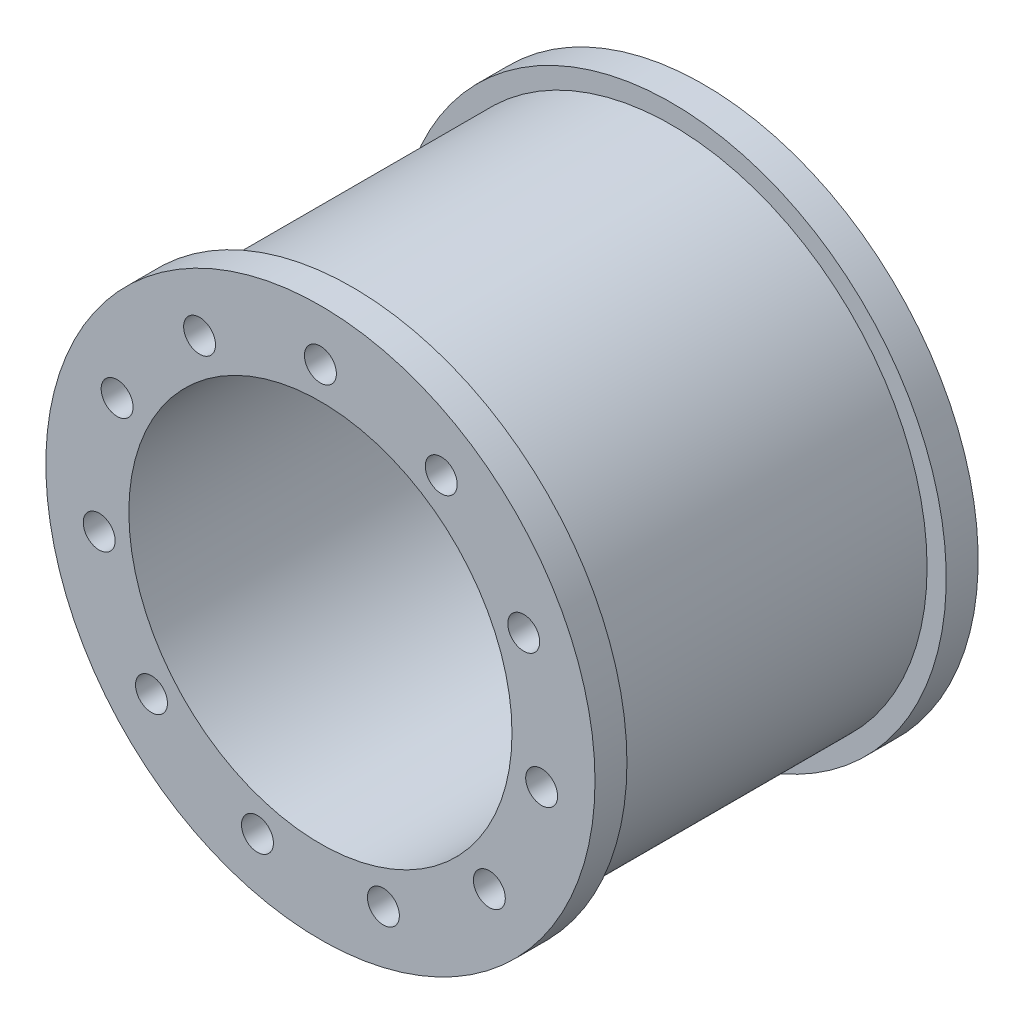
ISO-10303-21;
HEADER;
FILE_DESCRIPTION(('STEP AP214'),'2;1');
FILE_NAME('part.step','',(''),(''),'','','');
FILE_SCHEMA(('AUTOMOTIVE_DESIGN { 1 0 10303 214 1 1 1 1 }'));
ENDSEC;
DATA;
#1=APPLICATION_CONTEXT('core data for automotive mechanical design processes');
#2=APPLICATION_PROTOCOL_DEFINITION('international standard','automotive_design',2000,#1);
#3=PRODUCT_CONTEXT('',#1,'mechanical');
#4=PRODUCT('Part','Part','',(#3));
#5=PRODUCT_RELATED_PRODUCT_CATEGORY('part','',(#4));
#6=PRODUCT_DEFINITION_FORMATION('','',#4);
#7=PRODUCT_DEFINITION_CONTEXT('part definition',#1,'design');
#8=PRODUCT_DEFINITION('design','',#6,#7);
#9=PRODUCT_DEFINITION_SHAPE('','',#8);
#10=(LENGTH_UNIT() NAMED_UNIT(*) SI_UNIT(.MILLI.,.METRE.));
#11=(NAMED_UNIT(*) PLANE_ANGLE_UNIT() SI_UNIT($,.RADIAN.));
#12=(NAMED_UNIT(*) SI_UNIT($,.STERADIAN.) SOLID_ANGLE_UNIT());
#13=UNCERTAINTY_MEASURE_WITH_UNIT(LENGTH_MEASURE(1.E-05),#10,'distance_accuracy_value','');
#14=(GEOMETRIC_REPRESENTATION_CONTEXT(3) GLOBAL_UNCERTAINTY_ASSIGNED_CONTEXT((#13)) GLOBAL_UNIT_ASSIGNED_CONTEXT((#10,
#11,#12)) REPRESENTATION_CONTEXT('',''));
#15=CARTESIAN_POINT('',(0.,0.,0.));
#16=DIRECTION('',(0.,0.,1.));
#17=DIRECTION('',(1.,0.,0.));
#18=AXIS2_PLACEMENT_3D('',#15,#16,#17);
#19=CARTESIAN_POINT('',(0.,0.,50.));
#20=DIRECTION('',(0.,0.,-1.));
#21=DIRECTION('',(-1.,0.,0.));
#22=AXIS2_PLACEMENT_3D('',#19,#20,#21);
#23=CYLINDRICAL_SURFACE('',#22,40.);
#24=CARTESIAN_POINT('',(0.,0.,50.));
#25=DIRECTION('',(0.,0.,1.));
#26=DIRECTION('',(1.,0.,0.));
#27=AXIS2_PLACEMENT_3D('',#24,#25,#26);
#28=CIRCLE('',#27,40.);
#29=CARTESIAN_POINT('',(40.,0.,50.));
#30=VERTEX_POINT('',#29);
#31=EDGE_CURVE('E10',#30,#30,#28,.T.);
#32=ORIENTED_EDGE('',*,*,#31,.F.);
#33=EDGE_LOOP('',(#32));
#34=FACE_BOUND('',#33,.T.);
#35=CARTESIAN_POINT('',(0.,0.,0.));
#36=DIRECTION('',(0.,0.,1.));
#37=DIRECTION('',(1.,0.,0.));
#38=AXIS2_PLACEMENT_3D('',#35,#36,#37);
#39=CIRCLE('',#38,40.);
#40=CARTESIAN_POINT('',(40.,0.,0.));
#41=VERTEX_POINT('',#40);
#42=EDGE_CURVE('E43',#41,#41,#39,.T.);
#43=ORIENTED_EDGE('',*,*,#42,.T.);
#44=EDGE_LOOP('',(#43));
#45=FACE_BOUND('',#44,.T.);
#46=ADVANCED_FACE('F40',(#34,#45),#23,.T.);
#47=CARTESIAN_POINT('',(0.,0.,50.));
#48=DIRECTION('',(0.,0.,-1.));
#49=DIRECTION('',(-1.,0.,0.));
#50=AXIS2_PLACEMENT_3D('',#47,#48,#49);
#51=CYLINDRICAL_SURFACE('',#50,30.);
#52=CARTESIAN_POINT('',(0.,0.,-5.));
#53=DIRECTION('',(0.,0.,-1.));
#54=DIRECTION('',(-1.,0.,0.));
#55=AXIS2_PLACEMENT_3D('',#52,#53,#54);
#56=CIRCLE('',#55,30.);
#57=CARTESIAN_POINT('',(-30.,0.,-5.));
#58=VERTEX_POINT('',#57);
#59=EDGE_CURVE('E100',#58,#58,#56,.T.);
#60=ORIENTED_EDGE('',*,*,#59,.T.);
#61=EDGE_LOOP('',(#60));
#62=FACE_BOUND('',#61,.T.);
#63=CARTESIAN_POINT('',(0.,0.,55.));
#64=DIRECTION('',(0.,0.,1.));
#65=DIRECTION('',(1.,0.,0.));
#66=AXIS2_PLACEMENT_3D('',#63,#64,#65);
#67=CIRCLE('',#66,30.);
#68=CARTESIAN_POINT('',(30.,0.,55.));
#69=VERTEX_POINT('',#68);
#70=EDGE_CURVE('E112',#69,#69,#67,.T.);
#71=ORIENTED_EDGE('',*,*,#70,.T.);
#72=EDGE_LOOP('',(#71));
#73=FACE_BOUND('',#72,.T.);
#74=ADVANCED_FACE('F184',(#62,#73),#51,.F.);
#75=CARTESIAN_POINT('',(0.,0.,-5.));
#76=DIRECTION('',(0.,0.,-1.));
#77=DIRECTION('',(-1.,0.,0.));
#78=AXIS2_PLACEMENT_3D('',#75,#76,#77);
#79=PLANE('',#78);
#80=CARTESIAN_POINT('',(0.,0.,-5.));
#81=DIRECTION('',(0.,0.,-1.));
#82=DIRECTION('',(-1.,0.,0.));
#83=AXIS2_PLACEMENT_3D('',#80,#81,#82);
#84=CIRCLE('',#83,43.);
#85=CARTESIAN_POINT('',(-43.,0.,-5.));
#86=VERTEX_POINT('',#85);
#87=EDGE_CURVE('E99',#86,#86,#84,.T.);
#88=ORIENTED_EDGE('',*,*,#87,.T.);
#89=EDGE_LOOP('',(#88));
#90=FACE_BOUND('',#89,.T.);
#91=ORIENTED_EDGE('',*,*,#59,.F.);
#92=EDGE_LOOP('',(#91));
#93=FACE_BOUND('',#92,.T.);
#94=ADVANCED_FACE('F189',(#90,#93),#79,.T.);
#95=CARTESIAN_POINT('',(0.,0.,0.));
#96=DIRECTION('',(0.,0.,-1.));
#97=DIRECTION('',(-1.,0.,0.));
#98=AXIS2_PLACEMENT_3D('',#95,#96,#97);
#99=PLANE('',#98);
#100=ORIENTED_EDGE('',*,*,#42,.F.);
#101=EDGE_LOOP('',(#100));
#102=FACE_BOUND('',#101,.T.);
#103=CARTESIAN_POINT('',(0.,0.,0.));
#104=DIRECTION('',(0.,0.,-1.));
#105=DIRECTION('',(-1.,0.,0.));
#106=AXIS2_PLACEMENT_3D('',#103,#104,#105);
#107=CIRCLE('',#106,43.);
#108=CARTESIAN_POINT('',(-43.,0.,0.));
#109=VERTEX_POINT('',#108);
#110=EDGE_CURVE('E95',#109,#109,#107,.T.);
#111=ORIENTED_EDGE('',*,*,#110,.F.);
#112=EDGE_LOOP('',(#111));
#113=FACE_BOUND('',#112,.T.);
#114=ADVANCED_FACE('F178',(#102,#113),#99,.F.);
#115=CARTESIAN_POINT('',(0.,0.,-5.));
#116=DIRECTION('',(0.,0.,1.));
#117=DIRECTION('',(1.,0.,0.));
#118=AXIS2_PLACEMENT_3D('',#115,#116,#117);
#119=CYLINDRICAL_SURFACE('',#118,43.);
#120=ORIENTED_EDGE('',*,*,#87,.F.);
#121=EDGE_LOOP('',(#120));
#122=FACE_BOUND('',#121,.T.);
#123=ORIENTED_EDGE('',*,*,#110,.T.);
#124=EDGE_LOOP('',(#123));
#125=FACE_BOUND('',#124,.T.);
#126=ADVANCED_FACE('F169',(#122,#125),#119,.T.);
#127=CARTESIAN_POINT('',(0.,0.,55.));
#128=DIRECTION('',(0.,0.,1.));
#129=DIRECTION('',(1.,0.,0.));
#130=AXIS2_PLACEMENT_3D('',#127,#128,#129);
#131=PLANE('',#130);
#132=CARTESIAN_POINT('',(0.,35.,55.));
#133=DIRECTION('',(0.,0.,1.));
#134=DIRECTION('',(1.,0.,0.));
#135=AXIS2_PLACEMENT_3D('',#132,#133,#134);
#136=CIRCLE('',#135,2.5);
#137=CARTESIAN_POINT('',(2.5,35.,55.));
#138=VERTEX_POINT('',#137);
#139=EDGE_CURVE('E155',#138,#138,#136,.T.);
#140=ORIENTED_EDGE('',*,*,#139,.F.);
#141=EDGE_LOOP('',(#140));
#142=FACE_BOUND('',#141,.T.);
#143=CARTESIAN_POINT('',(-31.8371198374073,14.5395254550647,55.));
#144=DIRECTION('',(0.,0.,1.));
#145=DIRECTION('',(1.,0.,0.));
#146=AXIS2_PLACEMENT_3D('',#143,#144,#145);
#147=CIRCLE('',#146,2.50000000000164);
#148=CARTESIAN_POINT('',(-29.3371198374056,14.5395254550647,55.));
#149=VERTEX_POINT('',#148);
#150=EDGE_CURVE('E147',#149,#149,#147,.T.);
#151=ORIENTED_EDGE('',*,*,#150,.F.);
#152=EDGE_LOOP('',(#151));
#153=FACE_BOUND('',#152,.T.);
#154=CARTESIAN_POINT('',(-26.4512351023966,-22.9201256880861,55.));
#155=DIRECTION('',(0.,0.,1.));
#156=DIRECTION('',(1.,0.,0.));
#157=AXIS2_PLACEMENT_3D('',#154,#155,#156);
#158=CIRCLE('',#157,2.50000000000299);
#159=CARTESIAN_POINT('',(-23.9512351023936,-22.9201256880861,55.));
#160=VERTEX_POINT('',#159);
#161=EDGE_CURVE('E139',#160,#160,#158,.T.);
#162=ORIENTED_EDGE('',*,*,#161,.F.);
#163=EDGE_LOOP('',(#162));
#164=FACE_BOUND('',#163,.T.);
#165=CARTESIAN_POINT('',(9.86063948945295,-33.582254076507,55.));
#166=DIRECTION('',(0.,0.,1.));
#167=DIRECTION('',(1.,0.,0.));
#168=AXIS2_PLACEMENT_3D('',#165,#166,#167);
#169=CIRCLE('',#168,2.50000000000289);
#170=CARTESIAN_POINT('',(12.3606394894558,-33.582254076507,55.));
#171=VERTEX_POINT('',#170);
#172=EDGE_CURVE('E131',#171,#171,#169,.T.);
#173=ORIENTED_EDGE('',*,*,#172,.F.);
#174=EDGE_LOOP('',(#173));
#175=FACE_BOUND('',#174,.T.);
#176=CARTESIAN_POINT('',(34.6437504658343,-4.98101933956351,55.));
#177=DIRECTION('',(0.,0.,1.));
#178=DIRECTION('',(1.,0.,0.));
#179=AXIS2_PLACEMENT_3D('',#176,#177,#178);
#180=CIRCLE('',#179,2.50000000000133);
#181=CARTESIAN_POINT('',(37.1437504658357,-4.98101933956351,55.));
#182=VERTEX_POINT('',#181);
#183=EDGE_CURVE('E123',#182,#182,#180,.T.);
#184=ORIENTED_EDGE('',*,*,#183,.F.);
#185=EDGE_LOOP('',(#184));
#186=FACE_BOUND('',#185,.T.);
#187=ORIENTED_EDGE('',*,*,#70,.F.);
#188=EDGE_LOOP('',(#187));
#189=FACE_BOUND('',#188,.T.);
#190=CARTESIAN_POINT('',(0.,0.,55.));
#191=DIRECTION('',(0.,0.,1.));
#192=DIRECTION('',(1.,0.,0.));
#193=AXIS2_PLACEMENT_3D('',#190,#191,#192);
#194=CIRCLE('',#193,43.);
#195=CARTESIAN_POINT('',(43.,0.,55.));
#196=VERTEX_POINT('',#195);
#197=EDGE_CURVE('E107',#196,#196,#194,.T.);
#198=ORIENTED_EDGE('',*,*,#197,.T.);
#199=EDGE_LOOP('',(#198));
#200=FACE_BOUND('',#199,.T.);
#201=CARTESIAN_POINT('',(31.837119837409,14.5395254550674,55.));
#202=DIRECTION('',(0.,0.,1.));
#203=DIRECTION('',(1.,0.,0.));
#204=AXIS2_PLACEMENT_3D('',#201,#202,#203);
#205=CIRCLE('',#204,2.50000000000053);
#206=CARTESIAN_POINT('',(34.3371198374095,14.5395254550674,55.));
#207=VERTEX_POINT('',#206);
#208=EDGE_CURVE('E119',#207,#207,#205,.T.);
#209=ORIENTED_EDGE('',*,*,#208,.F.);
#210=EDGE_LOOP('',(#209));
#211=FACE_BOUND('',#210,.T.);
#212=CARTESIAN_POINT('',(26.4512351024015,-22.9201256880839,55.));
#213=DIRECTION('',(0.,0.,1.));
#214=DIRECTION('',(1.,0.,0.));
#215=AXIS2_PLACEMENT_3D('',#212,#213,#214);
#216=CIRCLE('',#215,2.5000000000022);
#217=CARTESIAN_POINT('',(28.9512351024037,-22.9201256880839,55.));
#218=VERTEX_POINT('',#217);
#219=EDGE_CURVE('E127',#218,#218,#216,.T.);
#220=ORIENTED_EDGE('',*,*,#219,.F.);
#221=EDGE_LOOP('',(#220));
#222=FACE_BOUND('',#221,.T.);
#223=CARTESIAN_POINT('',(-9.86063948944712,-33.5822540765078,55.));
#224=DIRECTION('',(0.,0.,1.));
#225=DIRECTION('',(1.,0.,0.));
#226=AXIS2_PLACEMENT_3D('',#223,#224,#225);
#227=CIRCLE('',#226,2.50000000000318);
#228=CARTESIAN_POINT('',(-7.36063948944395,-33.5822540765078,55.));
#229=VERTEX_POINT('',#228);
#230=EDGE_CURVE('E135',#229,#229,#227,.T.);
#231=ORIENTED_EDGE('',*,*,#230,.F.);
#232=EDGE_LOOP('',(#231));
#233=FACE_BOUND('',#232,.T.);
#234=CARTESIAN_POINT('',(-34.6437504658309,-4.98101933956645,55.));
#235=DIRECTION('',(0.,0.,1.));
#236=DIRECTION('',(1.,0.,0.));
#237=AXIS2_PLACEMENT_3D('',#234,#235,#236);
#238=CIRCLE('',#237,2.50000000000241);
#239=CARTESIAN_POINT('',(-32.1437504658285,-4.98101933956645,55.));
#240=VERTEX_POINT('',#239);
#241=EDGE_CURVE('E143',#240,#240,#238,.T.);
#242=ORIENTED_EDGE('',*,*,#241,.F.);
#243=EDGE_LOOP('',(#242));
#244=FACE_BOUND('',#243,.T.);
#245=CARTESIAN_POINT('',(-18.9224286109457,29.4438736490905,55.));
#246=DIRECTION('',(0.,0.,1.));
#247=DIRECTION('',(1.,0.,0.));
#248=AXIS2_PLACEMENT_3D('',#245,#246,#247);
#249=CIRCLE('',#248,2.50000000000091);
#250=CARTESIAN_POINT('',(-16.4224286109448,29.4438736490905,55.));
#251=VERTEX_POINT('',#250);
#252=EDGE_CURVE('E151',#251,#251,#249,.T.);
#253=ORIENTED_EDGE('',*,*,#252,.F.);
#254=EDGE_LOOP('',(#253));
#255=FACE_BOUND('',#254,.T.);
#256=CARTESIAN_POINT('',(18.922428610946,29.4438736490913,55.));
#257=DIRECTION('',(0.,0.,1.));
#258=DIRECTION('',(1.,0.,0.));
#259=AXIS2_PLACEMENT_3D('',#256,#257,#258);
#260=CIRCLE('',#259,2.5);
#261=CARTESIAN_POINT('',(21.422428610946,29.4438736490913,55.));
#262=VERTEX_POINT('',#261);
#263=EDGE_CURVE('E159',#262,#262,#260,.T.);
#264=ORIENTED_EDGE('',*,*,#263,.F.);
#265=EDGE_LOOP('',(#264));
#266=FACE_BOUND('',#265,.T.);
#267=ADVANCED_FACE('F166',(#142,#153,#164,#175,#186,#189,#200,#211,#222,#233,#244,#255,#266),
#131,.T.);
#268=CARTESIAN_POINT('',(0.,0.,50.));
#269=DIRECTION('',(0.,0.,1.));
#270=DIRECTION('',(1.,0.,0.));
#271=AXIS2_PLACEMENT_3D('',#268,#269,#270);
#272=PLANE('',#271);
#273=ORIENTED_EDGE('',*,*,#31,.T.);
#274=EDGE_LOOP('',(#273));
#275=FACE_BOUND('',#274,.T.);
#276=CARTESIAN_POINT('',(0.,0.,50.));
#277=DIRECTION('',(0.,0.,1.));
#278=DIRECTION('',(1.,0.,0.));
#279=AXIS2_PLACEMENT_3D('',#276,#277,#278);
#280=CIRCLE('',#279,43.);
#281=CARTESIAN_POINT('',(43.,0.,50.));
#282=VERTEX_POINT('',#281);
#283=EDGE_CURVE('E108',#282,#282,#280,.T.);
#284=ORIENTED_EDGE('',*,*,#283,.F.);
#285=EDGE_LOOP('',(#284));
#286=FACE_BOUND('',#285,.T.);
#287=ADVANCED_FACE('F168',(#275,#286),#272,.F.);
#288=CARTESIAN_POINT('',(0.,0.,55.));
#289=DIRECTION('',(0.,0.,-1.));
#290=DIRECTION('',(-1.,0.,0.));
#291=AXIS2_PLACEMENT_3D('',#288,#289,#290);
#292=CYLINDRICAL_SURFACE('',#291,43.);
#293=ORIENTED_EDGE('',*,*,#197,.F.);
#294=EDGE_LOOP('',(#293));
#295=FACE_BOUND('',#294,.T.);
#296=ORIENTED_EDGE('',*,*,#283,.T.);
#297=EDGE_LOOP('',(#296));
#298=FACE_BOUND('',#297,.T.);
#299=ADVANCED_FACE('F176',(#295,#298),#292,.T.);
#300=CARTESIAN_POINT('',(-18.9224286109457,29.4438736490905,0.));
#301=DIRECTION('',(0.,0.,1.));
#302=DIRECTION('',(1.,0.,0.));
#303=AXIS2_PLACEMENT_3D('',#300,#301,#302);
#304=CIRCLE('',#303,2.50000000000091);
#305=CARTESIAN_POINT('',(-16.4224286109448,29.4438736490905,0.));
#306=VERTEX_POINT('',#305);
#307=EDGE_CURVE('E91',#306,#306,#304,.T.);
#308=ORIENTED_EDGE('',*,*,#307,.T.);
#309=EDGE_LOOP('',(#308));
#310=FACE_BOUND('',#309,.T.);
#311=ADVANCED_FACE('F200',(#310),#99,.F.);
#312=CARTESIAN_POINT('',(-18.9224286109457,29.4438736490905,50.));
#313=DIRECTION('',(0.,0.,-1.));
#314=DIRECTION('',(-1.,0.,0.));
#315=AXIS2_PLACEMENT_3D('',#312,#313,#314);
#316=CYLINDRICAL_SURFACE('',#315,2.50000000000091);
#317=ORIENTED_EDGE('',*,*,#307,.F.);
#318=EDGE_LOOP('',(#317));
#319=FACE_BOUND('',#318,.T.);
#320=ORIENTED_EDGE('',*,*,#252,.T.);
#321=EDGE_LOOP('',(#320));
#322=FACE_BOUND('',#321,.T.);
#323=ADVANCED_FACE('F214',(#319,#322),#316,.F.);
#324=CARTESIAN_POINT('',(-34.6437504658309,-4.98101933956645,0.));
#325=DIRECTION('',(0.,0.,1.));
#326=DIRECTION('',(1.,0.,0.));
#327=AXIS2_PLACEMENT_3D('',#324,#325,#326);
#328=CIRCLE('',#327,2.50000000000241);
#329=CARTESIAN_POINT('',(-32.1437504658285,-4.98101933956645,0.));
#330=VERTEX_POINT('',#329);
#331=EDGE_CURVE('E83',#330,#330,#328,.T.);
#332=ORIENTED_EDGE('',*,*,#331,.T.);
#333=EDGE_LOOP('',(#332));
#334=FACE_BOUND('',#333,.T.);
#335=ADVANCED_FACE('F221',(#334),#99,.F.);
#336=CARTESIAN_POINT('',(-34.6437504658309,-4.98101933956645,50.));
#337=DIRECTION('',(0.,0.,-1.));
#338=DIRECTION('',(-1.,0.,0.));
#339=AXIS2_PLACEMENT_3D('',#336,#337,#338);
#340=CYLINDRICAL_SURFACE('',#339,2.50000000000241);
#341=ORIENTED_EDGE('',*,*,#331,.F.);
#342=EDGE_LOOP('',(#341));
#343=FACE_BOUND('',#342,.T.);
#344=ORIENTED_EDGE('',*,*,#241,.T.);
#345=EDGE_LOOP('',(#344));
#346=FACE_BOUND('',#345,.T.);
#347=ADVANCED_FACE('F240',(#343,#346),#340,.F.);
#348=CARTESIAN_POINT('',(-9.86063948944712,-33.5822540765078,0.));
#349=DIRECTION('',(0.,0.,1.));
#350=DIRECTION('',(1.,0.,0.));
#351=AXIS2_PLACEMENT_3D('',#348,#349,#350);
#352=CIRCLE('',#351,2.50000000000318);
#353=CARTESIAN_POINT('',(-7.36063948944395,-33.5822540765078,0.));
#354=VERTEX_POINT('',#353);
#355=EDGE_CURVE('E75',#354,#354,#352,.T.);
#356=ORIENTED_EDGE('',*,*,#355,.T.);
#357=EDGE_LOOP('',(#356));
#358=FACE_BOUND('',#357,.T.);
#359=ADVANCED_FACE('F245',(#358),#99,.F.);
#360=CARTESIAN_POINT('',(-9.86063948944712,-33.5822540765078,50.));
#361=DIRECTION('',(0.,0.,-1.));
#362=DIRECTION('',(-1.,0.,0.));
#363=AXIS2_PLACEMENT_3D('',#360,#361,#362);
#364=CYLINDRICAL_SURFACE('',#363,2.50000000000318);
#365=ORIENTED_EDGE('',*,*,#355,.F.);
#366=EDGE_LOOP('',(#365));
#367=FACE_BOUND('',#366,.T.);
#368=ORIENTED_EDGE('',*,*,#230,.T.);
#369=EDGE_LOOP('',(#368));
#370=FACE_BOUND('',#369,.T.);
#371=ADVANCED_FACE('F258',(#367,#370),#364,.F.);
#372=CARTESIAN_POINT('',(26.4512351024015,-22.9201256880839,0.));
#373=DIRECTION('',(0.,0.,1.));
#374=DIRECTION('',(1.,0.,0.));
#375=AXIS2_PLACEMENT_3D('',#372,#373,#374);
#376=CIRCLE('',#375,2.5000000000022);
#377=CARTESIAN_POINT('',(28.9512351024037,-22.9201256880839,0.));
#378=VERTEX_POINT('',#377);
#379=EDGE_CURVE('E67',#378,#378,#376,.T.);
#380=ORIENTED_EDGE('',*,*,#379,.T.);
#381=EDGE_LOOP('',(#380));
#382=FACE_BOUND('',#381,.T.);
#383=ADVANCED_FACE('F263',(#382),#99,.F.);
#384=CARTESIAN_POINT('',(26.4512351024015,-22.9201256880839,50.));
#385=DIRECTION('',(0.,0.,-1.));
#386=DIRECTION('',(-1.,0.,0.));
#387=AXIS2_PLACEMENT_3D('',#384,#385,#386);
#388=CYLINDRICAL_SURFACE('',#387,2.5000000000022);
#389=ORIENTED_EDGE('',*,*,#379,.F.);
#390=EDGE_LOOP('',(#389));
#391=FACE_BOUND('',#390,.T.);
#392=ORIENTED_EDGE('',*,*,#219,.T.);
#393=EDGE_LOOP('',(#392));
#394=FACE_BOUND('',#393,.T.);
#395=ADVANCED_FACE('F276',(#391,#394),#388,.F.);
#396=CARTESIAN_POINT('',(31.837119837409,14.5395254550674,0.));
#397=DIRECTION('',(0.,0.,1.));
#398=DIRECTION('',(1.,0.,0.));
#399=AXIS2_PLACEMENT_3D('',#396,#397,#398);
#400=CIRCLE('',#399,2.50000000000053);
#401=CARTESIAN_POINT('',(34.3371198374095,14.5395254550674,0.));
#402=VERTEX_POINT('',#401);
#403=EDGE_CURVE('E59',#402,#402,#400,.T.);
#404=ORIENTED_EDGE('',*,*,#403,.T.);
#405=EDGE_LOOP('',(#404));
#406=FACE_BOUND('',#405,.T.);
#407=ADVANCED_FACE('F281',(#406),#99,.F.);
#408=CARTESIAN_POINT('',(31.837119837409,14.5395254550674,50.));
#409=DIRECTION('',(0.,0.,-1.));
#410=DIRECTION('',(-1.,0.,0.));
#411=AXIS2_PLACEMENT_3D('',#408,#409,#410);
#412=CYLINDRICAL_SURFACE('',#411,2.50000000000053);
#413=ORIENTED_EDGE('',*,*,#403,.F.);
#414=EDGE_LOOP('',(#413));
#415=FACE_BOUND('',#414,.T.);
#416=ORIENTED_EDGE('',*,*,#208,.T.);
#417=EDGE_LOOP('',(#416));
#418=FACE_BOUND('',#417,.T.);
#419=ADVANCED_FACE('F210',(#415,#418),#412,.F.);
#420=CARTESIAN_POINT('',(0.,35.,0.));
#421=DIRECTION('',(0.,0.,1.));
#422=DIRECTION('',(1.,0.,0.));
#423=AXIS2_PLACEMENT_3D('',#420,#421,#422);
#424=CIRCLE('',#423,2.5);
#425=CARTESIAN_POINT('',(2.5,35.,0.));
#426=VERTEX_POINT('',#425);
#427=EDGE_CURVE('E48',#426,#426,#424,.T.);
#428=ORIENTED_EDGE('',*,*,#427,.T.);
#429=EDGE_LOOP('',(#428));
#430=FACE_BOUND('',#429,.T.);
#431=ADVANCED_FACE('F199',(#430),#99,.F.);
#432=CARTESIAN_POINT('',(0.,35.,50.));
#433=DIRECTION('',(0.,0.,-1.));
#434=DIRECTION('',(-1.,0.,0.));
#435=AXIS2_PLACEMENT_3D('',#432,#433,#434);
#436=CYLINDRICAL_SURFACE('',#435,2.5);
#437=ORIENTED_EDGE('',*,*,#427,.F.);
#438=EDGE_LOOP('',(#437));
#439=FACE_BOUND('',#438,.T.);
#440=ORIENTED_EDGE('',*,*,#139,.T.);
#441=EDGE_LOOP('',(#440));
#442=FACE_BOUND('',#441,.T.);
#443=ADVANCED_FACE('F209',(#439,#442),#436,.F.);
#444=CARTESIAN_POINT('',(18.922428610946,29.4438736490913,0.));
#445=DIRECTION('',(0.,0.,1.));
#446=DIRECTION('',(1.,0.,0.));
#447=AXIS2_PLACEMENT_3D('',#444,#445,#446);
#448=CIRCLE('',#447,2.5);
#449=CARTESIAN_POINT('',(21.422428610946,29.4438736490913,0.));
#450=VERTEX_POINT('',#449);
#451=EDGE_CURVE('E53',#450,#450,#448,.T.);
#452=ORIENTED_EDGE('',*,*,#451,.T.);
#453=EDGE_LOOP('',(#452));
#454=FACE_BOUND('',#453,.T.);
#455=ADVANCED_FACE('F212',(#454),#99,.F.);
#456=CARTESIAN_POINT('',(18.922428610946,29.4438736490913,50.));
#457=DIRECTION('',(0.,0.,-1.));
#458=DIRECTION('',(-1.,0.,0.));
#459=AXIS2_PLACEMENT_3D('',#456,#457,#458);
#460=CYLINDRICAL_SURFACE('',#459,2.5);
#461=ORIENTED_EDGE('',*,*,#451,.F.);
#462=EDGE_LOOP('',(#461));
#463=FACE_BOUND('',#462,.T.);
#464=ORIENTED_EDGE('',*,*,#263,.T.);
#465=EDGE_LOOP('',(#464));
#466=FACE_BOUND('',#465,.T.);
#467=ADVANCED_FACE('F164',(#463,#466),#460,.F.);
#468=CARTESIAN_POINT('',(34.6437504658343,-4.98101933956351,0.));
#469=DIRECTION('',(0.,0.,1.));
#470=DIRECTION('',(1.,0.,0.));
#471=AXIS2_PLACEMENT_3D('',#468,#469,#470);
#472=CIRCLE('',#471,2.50000000000133);
#473=CARTESIAN_POINT('',(37.1437504658357,-4.98101933956351,0.));
#474=VERTEX_POINT('',#473);
#475=EDGE_CURVE('E63',#474,#474,#472,.T.);
#476=ORIENTED_EDGE('',*,*,#475,.T.);
#477=EDGE_LOOP('',(#476));
#478=FACE_BOUND('',#477,.T.);
#479=ADVANCED_FACE('F272',(#478),#99,.F.);
#480=CARTESIAN_POINT('',(34.6437504658343,-4.98101933956351,50.));
#481=DIRECTION('',(0.,0.,-1.));
#482=DIRECTION('',(-1.,0.,0.));
#483=AXIS2_PLACEMENT_3D('',#480,#481,#482);
#484=CYLINDRICAL_SURFACE('',#483,2.50000000000133);
#485=ORIENTED_EDGE('',*,*,#475,.F.);
#486=EDGE_LOOP('',(#485));
#487=FACE_BOUND('',#486,.T.);
#488=ORIENTED_EDGE('',*,*,#183,.T.);
#489=EDGE_LOOP('',(#488));
#490=FACE_BOUND('',#489,.T.);
#491=ADVANCED_FACE('F267',(#487,#490),#484,.F.);
#492=CARTESIAN_POINT('',(9.86063948945295,-33.582254076507,0.));
#493=DIRECTION('',(0.,0.,1.));
#494=DIRECTION('',(1.,0.,0.));
#495=AXIS2_PLACEMENT_3D('',#492,#493,#494);
#496=CIRCLE('',#495,2.50000000000289);
#497=CARTESIAN_POINT('',(12.3606394894558,-33.582254076507,0.));
#498=VERTEX_POINT('',#497);
#499=EDGE_CURVE('E71',#498,#498,#496,.T.);
#500=ORIENTED_EDGE('',*,*,#499,.T.);
#501=EDGE_LOOP('',(#500));
#502=FACE_BOUND('',#501,.T.);
#503=ADVANCED_FACE('F254',(#502),#99,.F.);
#504=CARTESIAN_POINT('',(9.86063948945295,-33.582254076507,50.));
#505=DIRECTION('',(0.,0.,-1.));
#506=DIRECTION('',(-1.,0.,0.));
#507=AXIS2_PLACEMENT_3D('',#504,#505,#506);
#508=CYLINDRICAL_SURFACE('',#507,2.50000000000289);
#509=ORIENTED_EDGE('',*,*,#499,.F.);
#510=EDGE_LOOP('',(#509));
#511=FACE_BOUND('',#510,.T.);
#512=ORIENTED_EDGE('',*,*,#172,.T.);
#513=EDGE_LOOP('',(#512));
#514=FACE_BOUND('',#513,.T.);
#515=ADVANCED_FACE('F249',(#511,#514),#508,.F.);
#516=CARTESIAN_POINT('',(-26.4512351023966,-22.9201256880861,0.));
#517=DIRECTION('',(0.,0.,1.));
#518=DIRECTION('',(1.,0.,0.));
#519=AXIS2_PLACEMENT_3D('',#516,#517,#518);
#520=CIRCLE('',#519,2.50000000000299);
#521=CARTESIAN_POINT('',(-23.9512351023936,-22.9201256880861,0.));
#522=VERTEX_POINT('',#521);
#523=EDGE_CURVE('E79',#522,#522,#520,.T.);
#524=ORIENTED_EDGE('',*,*,#523,.T.);
#525=EDGE_LOOP('',(#524));
#526=FACE_BOUND('',#525,.T.);
#527=ADVANCED_FACE('F236',(#526),#99,.F.);
#528=CARTESIAN_POINT('',(-26.4512351023966,-22.9201256880861,50.));
#529=DIRECTION('',(0.,0.,-1.));
#530=DIRECTION('',(-1.,0.,0.));
#531=AXIS2_PLACEMENT_3D('',#528,#529,#530);
#532=CYLINDRICAL_SURFACE('',#531,2.50000000000299);
#533=ORIENTED_EDGE('',*,*,#523,.F.);
#534=EDGE_LOOP('',(#533));
#535=FACE_BOUND('',#534,.T.);
#536=ORIENTED_EDGE('',*,*,#161,.T.);
#537=EDGE_LOOP('',(#536));
#538=FACE_BOUND('',#537,.T.);
#539=ADVANCED_FACE('F228',(#535,#538),#532,.F.);
#540=CARTESIAN_POINT('',(-31.8371198374073,14.5395254550647,0.));
#541=DIRECTION('',(0.,0.,1.));
#542=DIRECTION('',(1.,0.,0.));
#543=AXIS2_PLACEMENT_3D('',#540,#541,#542);
#544=CIRCLE('',#543,2.50000000000164);
#545=CARTESIAN_POINT('',(-29.3371198374056,14.5395254550647,0.));
#546=VERTEX_POINT('',#545);
#547=EDGE_CURVE('E87',#546,#546,#544,.T.);
#548=ORIENTED_EDGE('',*,*,#547,.T.);
#549=EDGE_LOOP('',(#548));
#550=FACE_BOUND('',#549,.T.);
#551=ADVANCED_FACE('F216',(#550),#99,.F.);
#552=CARTESIAN_POINT('',(-31.8371198374073,14.5395254550647,50.));
#553=DIRECTION('',(0.,0.,-1.));
#554=DIRECTION('',(-1.,0.,0.));
#555=AXIS2_PLACEMENT_3D('',#552,#553,#554);
#556=CYLINDRICAL_SURFACE('',#555,2.50000000000164);
#557=ORIENTED_EDGE('',*,*,#547,.F.);
#558=EDGE_LOOP('',(#557));
#559=FACE_BOUND('',#558,.T.);
#560=ORIENTED_EDGE('',*,*,#150,.T.);
#561=EDGE_LOOP('',(#560));
#562=FACE_BOUND('',#561,.T.);
#563=ADVANCED_FACE('F227',(#559,#562),#556,.F.);
#564=CLOSED_SHELL('',(#46,#74,#94,#114,#126,#267,#287,#299,#311,#323,#335,#347,#359,#371,#383,
#395,#407,#419,#431,#443,#455,#467,#479,#491,#503,#515,#527,#539,#551,#563));
#565=MANIFOLD_SOLID_BREP('B2',#564);
#566=ADVANCED_BREP_SHAPE_REPRESENTATION('',(#18,#565),#14);
#567=SHAPE_DEFINITION_REPRESENTATION(#9,#566);
ENDSEC;
END-ISO-10303-21;
